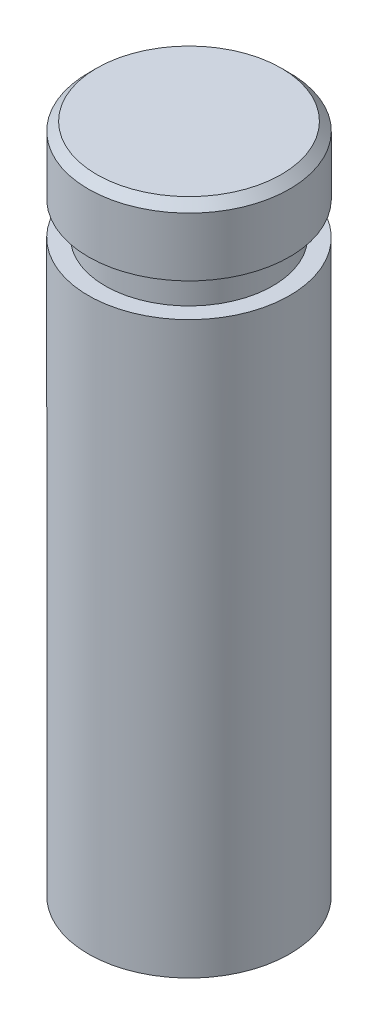
ISO-10303-21;
HEADER;
FILE_DESCRIPTION(('STEP AP214'),'2;1');
FILE_NAME('part.step','',(''),(''),'','','');
FILE_SCHEMA(('AUTOMOTIVE_DESIGN { 1 0 10303 214 1 1 1 1 }'));
ENDSEC;
DATA;
#1=APPLICATION_CONTEXT('core data for automotive mechanical design processes');
#2=APPLICATION_PROTOCOL_DEFINITION('international standard','automotive_design',2000,#1);
#3=PRODUCT_CONTEXT('',#1,'mechanical');
#4=PRODUCT('Part','Part','',(#3));
#5=PRODUCT_RELATED_PRODUCT_CATEGORY('part','',(#4));
#6=PRODUCT_DEFINITION_FORMATION('','',#4);
#7=PRODUCT_DEFINITION_CONTEXT('part definition',#1,'design');
#8=PRODUCT_DEFINITION('design','',#6,#7);
#9=PRODUCT_DEFINITION_SHAPE('','',#8);
#10=(LENGTH_UNIT() NAMED_UNIT(*) SI_UNIT(.MILLI.,.METRE.));
#11=(NAMED_UNIT(*) PLANE_ANGLE_UNIT() SI_UNIT($,.RADIAN.));
#12=(NAMED_UNIT(*) SI_UNIT($,.STERADIAN.) SOLID_ANGLE_UNIT());
#13=UNCERTAINTY_MEASURE_WITH_UNIT(LENGTH_MEASURE(1.E-05),#10,'distance_accuracy_value','');
#14=(GEOMETRIC_REPRESENTATION_CONTEXT(3) GLOBAL_UNCERTAINTY_ASSIGNED_CONTEXT((#13)) GLOBAL_UNIT_ASSIGNED_CONTEXT((#10,
#11,#12)) REPRESENTATION_CONTEXT('',''));
#15=CARTESIAN_POINT('',(0.,0.,0.));
#16=DIRECTION('',(0.,0.,1.));
#17=DIRECTION('',(1.,0.,0.));
#18=AXIS2_PLACEMENT_3D('',#15,#16,#17);
#19=CARTESIAN_POINT('',(0.,40.,0.));
#20=DIRECTION('',(0.,-1.,0.));
#21=DIRECTION('',(0.,0.,-1.));
#22=AXIS2_PLACEMENT_3D('',#19,#20,#21);
#23=CYLINDRICAL_SURFACE('',#22,6.);
#24=CARTESIAN_POINT('',(0.,34.,0.));
#25=DIRECTION('',(0.,-1.,0.));
#26=DIRECTION('',(0.,0.,-1.));
#27=AXIS2_PLACEMENT_3D('',#24,#25,#26);
#28=CIRCLE('',#27,6.);
#29=CARTESIAN_POINT('',(0.,34.,-6.));
#30=VERTEX_POINT('',#29);
#31=EDGE_CURVE('E32',#30,#30,#28,.T.);
#32=ORIENTED_EDGE('',*,*,#31,.T.);
#33=EDGE_LOOP('',(#32));
#34=FACE_BOUND('',#33,.T.);
#35=CARTESIAN_POINT('',(0.,0.,0.));
#36=DIRECTION('',(0.,1.,0.));
#37=DIRECTION('',(0.,0.,1.));
#38=AXIS2_PLACEMENT_3D('',#35,#36,#37);
#39=CIRCLE('',#38,6.);
#40=CARTESIAN_POINT('',(0.,0.,6.));
#41=VERTEX_POINT('',#40);
#42=EDGE_CURVE('E41',#41,#41,#39,.T.);
#43=ORIENTED_EDGE('',*,*,#42,.T.);
#44=EDGE_LOOP('',(#43));
#45=FACE_BOUND('',#44,.T.);
#46=ADVANCED_FACE('F28',(#34,#45),#23,.T.);
#47=CARTESIAN_POINT('',(0.,0.,0.));
#48=DIRECTION('',(0.,1.,0.));
#49=DIRECTION('',(0.,0.,1.));
#50=AXIS2_PLACEMENT_3D('',#47,#48,#49);
#51=PLANE('',#50);
#52=CARTESIAN_POINT('',(0.,0.,0.));
#53=DIRECTION('',(0.,-1.,0.));
#54=DIRECTION('',(0.,0.,-1.));
#55=AXIS2_PLACEMENT_3D('',#52,#53,#54);
#56=CIRCLE('',#55,5.);
#57=CARTESIAN_POINT('',(0.,0.,-5.));
#58=VERTEX_POINT('',#57);
#59=EDGE_CURVE('E50',#58,#58,#56,.T.);
#60=ORIENTED_EDGE('',*,*,#59,.F.);
#61=EDGE_LOOP('',(#60));
#62=FACE_BOUND('',#61,.T.);
#63=ORIENTED_EDGE('',*,*,#42,.F.);
#64=EDGE_LOOP('',(#63));
#65=FACE_BOUND('',#64,.T.);
#66=ADVANCED_FACE('F67',(#62,#65),#51,.F.);
#67=CARTESIAN_POINT('',(0.,30.,0.));
#68=DIRECTION('',(0.,-1.,0.));
#69=DIRECTION('',(0.,0.,-1.));
#70=AXIS2_PLACEMENT_3D('',#67,#68,#69);
#71=CYLINDRICAL_SURFACE('',#70,5.);
#72=CARTESIAN_POINT('',(0.,30.,0.));
#73=DIRECTION('',(0.,-1.,0.));
#74=DIRECTION('',(0.,0.,-1.));
#75=AXIS2_PLACEMENT_3D('',#72,#73,#74);
#76=CIRCLE('',#75,5.);
#77=CARTESIAN_POINT('',(0.,30.,-5.));
#78=VERTEX_POINT('',#77);
#79=EDGE_CURVE('E59',#78,#78,#76,.T.);
#80=ORIENTED_EDGE('',*,*,#79,.F.);
#81=EDGE_LOOP('',(#80));
#82=FACE_BOUND('',#81,.T.);
#83=ORIENTED_EDGE('',*,*,#59,.T.);
#84=EDGE_LOOP('',(#83));
#85=FACE_BOUND('',#84,.T.);
#86=ADVANCED_FACE('F69',(#82,#85),#71,.F.);
#87=CARTESIAN_POINT('',(0.,30.,0.));
#88=DIRECTION('',(0.,-1.,0.));
#89=DIRECTION('',(0.,0.,-1.));
#90=AXIS2_PLACEMENT_3D('',#87,#88,#89);
#91=PLANE('',#90);
#92=ORIENTED_EDGE('',*,*,#79,.T.);
#93=EDGE_LOOP('',(#92));
#94=FACE_BOUND('',#93,.T.);
#95=ADVANCED_FACE('F76',(#94),#91,.T.);
#96=CARTESIAN_POINT('',(5.,34.,0.));
#97=DIRECTION('',(0.,-1.,0.));
#98=DIRECTION('',(0.,0.,-1.));
#99=AXIS2_PLACEMENT_3D('',#96,#97,#98);
#100=PLANE('',#99);
#101=CARTESIAN_POINT('',(0.,34.,0.));
#102=DIRECTION('',(0.,-1.,0.));
#103=DIRECTION('',(0.,0.,-1.));
#104=AXIS2_PLACEMENT_3D('',#101,#102,#103);
#105=CIRCLE('',#104,5.);
#106=CARTESIAN_POINT('',(0.,34.,-5.));
#107=VERTEX_POINT('',#106);
#108=EDGE_CURVE('E46',#107,#107,#105,.T.);
#109=ORIENTED_EDGE('',*,*,#108,.T.);
#110=EDGE_LOOP('',(#109));
#111=FACE_BOUND('',#110,.T.);
#112=ORIENTED_EDGE('',*,*,#31,.F.);
#113=EDGE_LOOP('',(#112));
#114=FACE_BOUND('',#113,.T.);
#115=ADVANCED_FACE('F105',(#111,#114),#100,.F.);
#116=CARTESIAN_POINT('',(5.,36.,0.));
#117=DIRECTION('',(0.,1.,0.));
#118=DIRECTION('',(0.,0.,1.));
#119=AXIS2_PLACEMENT_3D('',#116,#117,#118);
#120=PLANE('',#119);
#121=CARTESIAN_POINT('',(0.,36.,0.));
#122=DIRECTION('',(0.,-1.,0.));
#123=DIRECTION('',(0.,0.,-1.));
#124=AXIS2_PLACEMENT_3D('',#121,#122,#123);
#125=CIRCLE('',#124,5.);
#126=CARTESIAN_POINT('',(0.,36.,-5.));
#127=VERTEX_POINT('',#126);
#128=EDGE_CURVE('E52',#127,#127,#125,.T.);
#129=ORIENTED_EDGE('',*,*,#128,.F.);
#130=EDGE_LOOP('',(#129));
#131=FACE_BOUND('',#130,.T.);
#132=CARTESIAN_POINT('',(0.,36.,0.));
#133=DIRECTION('',(0.,1.,0.));
#134=DIRECTION('',(0.,0.,1.));
#135=AXIS2_PLACEMENT_3D('',#132,#133,#134);
#136=CIRCLE('',#135,6.);
#137=CARTESIAN_POINT('',(0.,36.,6.));
#138=VERTEX_POINT('',#137);
#139=EDGE_CURVE('E44',#138,#138,#136,.T.);
#140=ORIENTED_EDGE('',*,*,#139,.F.);
#141=EDGE_LOOP('',(#140));
#142=FACE_BOUND('',#141,.T.);
#143=ADVANCED_FACE('F99',(#131,#142),#120,.F.);
#144=CARTESIAN_POINT('',(0.,0.,0.));
#145=DIRECTION('',(0.,-1.,0.));
#146=DIRECTION('',(0.,0.,-1.));
#147=AXIS2_PLACEMENT_3D('',#144,#145,#146);
#148=CYLINDRICAL_SURFACE('',#147,5.);
#149=ORIENTED_EDGE('',*,*,#108,.F.);
#150=EDGE_LOOP('',(#149));
#151=FACE_BOUND('',#150,.T.);
#152=ORIENTED_EDGE('',*,*,#128,.T.);
#153=EDGE_LOOP('',(#152));
#154=FACE_BOUND('',#153,.T.);
#155=ADVANCED_FACE('F92',(#151,#154),#148,.T.);
#156=CARTESIAN_POINT('',(0.,40.,0.));
#157=DIRECTION('',(0.,1.,0.));
#158=DIRECTION('',(0.,0.,1.));
#159=AXIS2_PLACEMENT_3D('',#156,#157,#158);
#160=PLANE('',#159);
#161=CARTESIAN_POINT('',(0.,40.,0.));
#162=DIRECTION('',(0.,1.,0.));
#163=DIRECTION('',(0.,0.,1.));
#164=AXIS2_PLACEMENT_3D('',#161,#162,#163);
#165=CIRCLE('',#164,5.50000000000001);
#166=CARTESIAN_POINT('',(0.,40.,5.50000000000001));
#167=VERTEX_POINT('',#166);
#168=EDGE_CURVE('E36',#167,#167,#165,.T.);
#169=ORIENTED_EDGE('',*,*,#168,.T.);
#170=EDGE_LOOP('',(#169));
#171=FACE_BOUND('',#170,.T.);
#172=ADVANCED_FACE('F83',(#171),#160,.T.);
#173=CARTESIAN_POINT('',(0.,40.,0.));
#174=DIRECTION('',(0.,-1.,0.));
#175=DIRECTION('',(0.,0.,-1.));
#176=AXIS2_PLACEMENT_3D('',#173,#174,#175);
#177=CONICAL_SURFACE('',#176,5.50000000000001,0.785398163397444);
#178=CARTESIAN_POINT('',(0.,39.5,0.));
#179=DIRECTION('',(0.,1.,0.));
#180=DIRECTION('',(0.,0.,1.));
#181=AXIS2_PLACEMENT_3D('',#178,#179,#180);
#182=CIRCLE('',#181,6.);
#183=CARTESIAN_POINT('',(0.,39.5,6.));
#184=VERTEX_POINT('',#183);
#185=EDGE_CURVE('E10',#184,#184,#182,.F.);
#186=ORIENTED_EDGE('',*,*,#185,.F.);
#187=EDGE_LOOP('',(#186));
#188=FACE_BOUND('',#187,.T.);
#189=ORIENTED_EDGE('',*,*,#168,.F.);
#190=EDGE_LOOP('',(#189));
#191=FACE_BOUND('',#190,.T.);
#192=ADVANCED_FACE('F30',(#188,#191),#177,.T.);
#193=ORIENTED_EDGE('',*,*,#139,.T.);
#194=EDGE_LOOP('',(#193));
#195=FACE_BOUND('',#194,.T.);
#196=ORIENTED_EDGE('',*,*,#185,.T.);
#197=EDGE_LOOP('',(#196));
#198=FACE_BOUND('',#197,.T.);
#199=ADVANCED_FACE('F80',(#195,#198),#23,.T.);
#200=CLOSED_SHELL('',(#46,#66,#86,#95,#115,#143,#155,#172,#192,#199));
#201=MANIFOLD_SOLID_BREP('B2',#200);
#202=ADVANCED_BREP_SHAPE_REPRESENTATION('',(#18,#201),#14);
#203=SHAPE_DEFINITION_REPRESENTATION(#9,#202);
ENDSEC;
END-ISO-10303-21;
